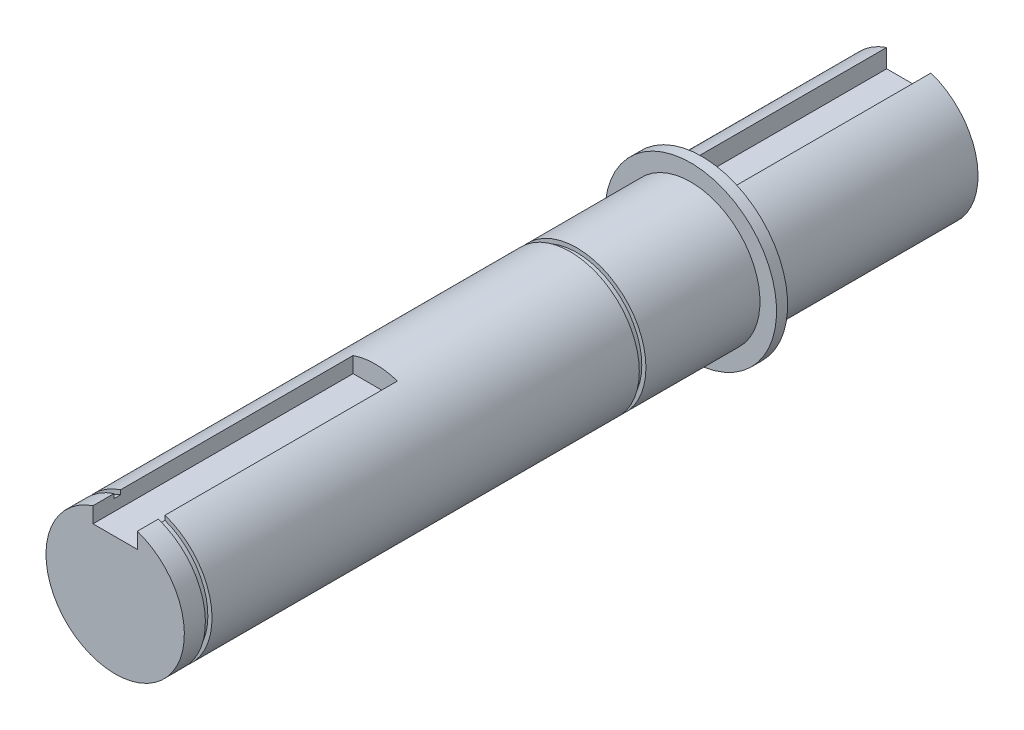
ISO-10303-21;
HEADER;
FILE_DESCRIPTION(('STEP AP214'),'2;1');
FILE_NAME('part.step','',(''),(''),'','','');
FILE_SCHEMA(('AUTOMOTIVE_DESIGN { 1 0 10303 214 1 1 1 1 }'));
ENDSEC;
DATA;
#1=APPLICATION_CONTEXT('core data for automotive mechanical design processes');
#2=APPLICATION_PROTOCOL_DEFINITION('international standard','automotive_design',2000,#1);
#3=PRODUCT_CONTEXT('',#1,'mechanical');
#4=PRODUCT('Part','Part','',(#3));
#5=PRODUCT_RELATED_PRODUCT_CATEGORY('part','',(#4));
#6=PRODUCT_DEFINITION_FORMATION('','',#4);
#7=PRODUCT_DEFINITION_CONTEXT('part definition',#1,'design');
#8=PRODUCT_DEFINITION('design','',#6,#7);
#9=PRODUCT_DEFINITION_SHAPE('','',#8);
#10=(LENGTH_UNIT() NAMED_UNIT(*) SI_UNIT(.MILLI.,.METRE.));
#11=(NAMED_UNIT(*) PLANE_ANGLE_UNIT() SI_UNIT($,.RADIAN.));
#12=(NAMED_UNIT(*) SI_UNIT($,.STERADIAN.) SOLID_ANGLE_UNIT());
#13=UNCERTAINTY_MEASURE_WITH_UNIT(LENGTH_MEASURE(1.E-05),#10,'distance_accuracy_value','');
#14=(GEOMETRIC_REPRESENTATION_CONTEXT(3) GLOBAL_UNCERTAINTY_ASSIGNED_CONTEXT((#13)) GLOBAL_UNIT_ASSIGNED_CONTEXT((#10,
#11,#12)) REPRESENTATION_CONTEXT('',''));
#15=CARTESIAN_POINT('',(0.,0.,0.));
#16=DIRECTION('',(0.,0.,1.));
#17=DIRECTION('',(1.,0.,0.));
#18=AXIS2_PLACEMENT_3D('',#15,#16,#17);
#19=CARTESIAN_POINT('',(0.,0.,143.4));
#20=DIRECTION('',(0.,0.,-1.));
#21=DIRECTION('',(-1.,0.,0.));
#22=AXIS2_PLACEMENT_3D('',#19,#20,#21);
#23=CYLINDRICAL_SURFACE('',#22,12.5);
#24=CARTESIAN_POINT('',(0.,0.,61.2));
#25=DIRECTION('',(0.,0.,1.));
#26=DIRECTION('',(1.,0.,0.));
#27=AXIS2_PLACEMENT_3D('',#24,#25,#26);
#28=CIRCLE('',#27,12.5);
#29=CARTESIAN_POINT('',(12.5,0.,61.2));
#30=VERTEX_POINT('',#29);
#31=EDGE_CURVE('E198',#30,#30,#28,.T.);
#32=ORIENTED_EDGE('',*,*,#31,.T.);
#33=EDGE_LOOP('',(#32));
#34=FACE_BOUND('',#33,.T.);
#35=CARTESIAN_POINT('',(0.,0.,138.4));
#36=DIRECTION('',(0.,0.,1.));
#37=DIRECTION('',(1.,0.,0.));
#38=AXIS2_PLACEMENT_3D('',#35,#36,#37);
#39=CIRCLE('',#38,12.5);
#40=CARTESIAN_POINT('',(-4.,11.842719282327,138.4));
#41=VERTEX_POINT('',#40);
#42=CARTESIAN_POINT('',(4.,11.842719282327,138.4));
#43=VERTEX_POINT('',#42);
#44=EDGE_CURVE('E153',#41,#43,#39,.T.);
#45=ORIENTED_EDGE('',*,*,#44,.F.);
#46=DIRECTION('',(0.,0.,-1.));
#47=VECTOR('',#46,1.);
#48=CARTESIAN_POINT('',(-4.,11.842719282327,143.4));
#49=LINE('',#48,#47);
#50=CARTESIAN_POINT('',(-4.,11.842719282327,96.4));
#51=VERTEX_POINT('',#50);
#52=EDGE_CURVE('E274',#41,#51,#49,.T.);
#53=ORIENTED_EDGE('',*,*,#52,.T.);
#54=CARTESIAN_POINT('',(0.,0.,96.4));
#55=DIRECTION('',(0.,0.,-1.));
#56=DIRECTION('',(-1.,0.,0.));
#57=AXIS2_PLACEMENT_3D('',#54,#55,#56);
#58=CIRCLE('',#57,12.5);
#59=CARTESIAN_POINT('',(4.,11.842719282327,96.4));
#60=VERTEX_POINT('',#59);
#61=EDGE_CURVE('E270',#51,#60,#58,.T.);
#62=ORIENTED_EDGE('',*,*,#61,.T.);
#63=DIRECTION('',(0.,0.,-1.));
#64=VECTOR('',#63,1.);
#65=CARTESIAN_POINT('',(4.,11.842719282327,143.4));
#66=LINE('',#65,#64);
#67=EDGE_CURVE('E279',#60,#43,#66,.F.);
#68=ORIENTED_EDGE('',*,*,#67,.T.);
#69=EDGE_LOOP('',(#45,#53,#62,#68));
#70=FACE_BOUND('',#69,.T.);
#71=ADVANCED_FACE('F45',(#34,#70),#23,.T.);
#72=CARTESIAN_POINT('',(0.,0.,39.4));
#73=DIRECTION('',(0.,0.,-1.));
#74=DIRECTION('',(-1.,0.,0.));
#75=AXIS2_PLACEMENT_3D('',#72,#73,#74);
#76=CIRCLE('',#75,12.5);
#77=CARTESIAN_POINT('',(-12.5,0.,39.4));
#78=VERTEX_POINT('',#77);
#79=EDGE_CURVE('E263',#78,#78,#76,.T.);
#80=ORIENTED_EDGE('',*,*,#79,.F.);
#81=EDGE_LOOP('',(#80));
#82=FACE_BOUND('',#81,.T.);
#83=CARTESIAN_POINT('',(0.,0.,60.));
#84=DIRECTION('',(0.,0.,1.));
#85=DIRECTION('',(1.,0.,0.));
#86=AXIS2_PLACEMENT_3D('',#83,#84,#85);
#87=CIRCLE('',#86,12.5);
#88=CARTESIAN_POINT('',(12.5,0.,60.));
#89=VERTEX_POINT('',#88);
#90=EDGE_CURVE('E194',#89,#89,#87,.T.);
#91=ORIENTED_EDGE('',*,*,#90,.F.);
#92=EDGE_LOOP('',(#91));
#93=FACE_BOUND('',#92,.T.);
#94=ADVANCED_FACE('F322',(#82,#93),#23,.T.);
#95=CARTESIAN_POINT('',(0.,0.,37.4));
#96=DIRECTION('',(0.,0.,-1.));
#97=DIRECTION('',(-1.,0.,0.));
#98=AXIS2_PLACEMENT_3D('',#95,#96,#97);
#99=CIRCLE('',#98,12.5);
#100=CARTESIAN_POINT('',(-12.5,0.,37.4));
#101=VERTEX_POINT('',#100);
#102=EDGE_CURVE('E210',#101,#101,#99,.T.);
#103=ORIENTED_EDGE('',*,*,#102,.T.);
#104=EDGE_LOOP('',(#103));
#105=FACE_BOUND('',#104,.T.);
#106=CARTESIAN_POINT('',(0.,0.,35.4));
#107=DIRECTION('',(0.,0.,1.));
#108=DIRECTION('',(1.,0.,0.));
#109=AXIS2_PLACEMENT_3D('',#106,#107,#108);
#110=CIRCLE('',#109,12.5);
#111=CARTESIAN_POINT('',(4.,11.842719282327,35.4));
#112=VERTEX_POINT('',#111);
#113=CARTESIAN_POINT('',(-4.,11.842719282327,35.4));
#114=VERTEX_POINT('',#113);
#115=EDGE_CURVE('E259',#112,#114,#110,.T.);
#116=ORIENTED_EDGE('',*,*,#115,.T.);
#117=DIRECTION('',(0.,0.,-1.));
#118=VECTOR('',#117,1.);
#119=CARTESIAN_POINT('',(-4.,11.842719282327,143.4));
#120=LINE('',#119,#118);
#121=CARTESIAN_POINT('',(-4.,11.842719282327,0.));
#122=VERTEX_POINT('',#121);
#123=EDGE_CURVE('E243',#114,#122,#120,.T.);
#124=ORIENTED_EDGE('',*,*,#123,.T.);
#125=CARTESIAN_POINT('',(0.,0.,0.));
#126=DIRECTION('',(0.,0.,1.));
#127=DIRECTION('',(1.,0.,0.));
#128=AXIS2_PLACEMENT_3D('',#125,#126,#127);
#129=CIRCLE('',#128,12.5);
#130=CARTESIAN_POINT('',(4.,11.842719282327,0.));
#131=VERTEX_POINT('',#130);
#132=EDGE_CURVE('E247',#122,#131,#129,.T.);
#133=ORIENTED_EDGE('',*,*,#132,.T.);
#134=DIRECTION('',(0.,0.,-1.));
#135=VECTOR('',#134,1.);
#136=CARTESIAN_POINT('',(4.,11.842719282327,143.4));
#137=LINE('',#136,#135);
#138=EDGE_CURVE('E236',#131,#112,#137,.F.);
#139=ORIENTED_EDGE('',*,*,#138,.T.);
#140=EDGE_LOOP('',(#116,#124,#133,#139));
#141=FACE_BOUND('',#140,.T.);
#142=ADVANCED_FACE('F47',(#105,#141),#23,.T.);
#143=CARTESIAN_POINT('',(0.,0.,0.));
#144=DIRECTION('',(0.,0.,1.));
#145=DIRECTION('',(1.,0.,0.));
#146=AXIS2_PLACEMENT_3D('',#143,#144,#145);
#147=PLANE('',#146);
#148=ORIENTED_EDGE('',*,*,#132,.F.);
#149=DIRECTION('',(0.,1.,0.));
#150=VECTOR('',#149,1.);
#151=CARTESIAN_POINT('',(-4.,8.5,0.));
#152=LINE('',#151,#150);
#153=CARTESIAN_POINT('',(-4.,8.5,0.));
#154=VERTEX_POINT('',#153);
#155=EDGE_CURVE('E227',#154,#122,#152,.T.);
#156=ORIENTED_EDGE('',*,*,#155,.F.);
#157=DIRECTION('',(-1.,0.,0.));
#158=VECTOR('',#157,1.);
#159=CARTESIAN_POINT('',(4.,8.5,0.));
#160=LINE('',#159,#158);
#161=CARTESIAN_POINT('',(4.,8.5,0.));
#162=VERTEX_POINT('',#161);
#163=EDGE_CURVE('E219',#162,#154,#160,.T.);
#164=ORIENTED_EDGE('',*,*,#163,.F.);
#165=DIRECTION('',(0.,1.,0.));
#166=VECTOR('',#165,1.);
#167=CARTESIAN_POINT('',(4.,0.,0.));
#168=LINE('',#167,#166);
#169=EDGE_CURVE('E252',#162,#131,#168,.T.);
#170=ORIENTED_EDGE('',*,*,#169,.T.);
#171=EDGE_LOOP('',(#148,#156,#164,#170));
#172=FACE_BOUND('',#171,.T.);
#173=ADVANCED_FACE('F329',(#172),#147,.F.);
#174=CARTESIAN_POINT('',(0.,0.,35.4));
#175=DIRECTION('',(0.,0.,1.));
#176=DIRECTION('',(1.,0.,0.));
#177=AXIS2_PLACEMENT_3D('',#174,#175,#176);
#178=PLANE('',#177);
#179=DIRECTION('',(0.,-1.,0.));
#180=VECTOR('',#179,1.);
#181=CARTESIAN_POINT('',(4.,8.5,35.4));
#182=LINE('',#181,#180);
#183=CARTESIAN_POINT('',(4.,8.5,35.4));
#184=VERTEX_POINT('',#183);
#185=EDGE_CURVE('E218',#112,#184,#182,.T.);
#186=ORIENTED_EDGE('',*,*,#185,.T.);
#187=DIRECTION('',(-1.,0.,0.));
#188=VECTOR('',#187,1.);
#189=CARTESIAN_POINT('',(4.,8.5,35.4));
#190=LINE('',#189,#188);
#191=CARTESIAN_POINT('',(-4.,8.5,35.4));
#192=VERTEX_POINT('',#191);
#193=EDGE_CURVE('E222',#184,#192,#190,.T.);
#194=ORIENTED_EDGE('',*,*,#193,.T.);
#195=DIRECTION('',(0.,1.,0.));
#196=VECTOR('',#195,1.);
#197=CARTESIAN_POINT('',(-4.,8.5,35.4));
#198=LINE('',#197,#196);
#199=EDGE_CURVE('E214',#192,#114,#198,.T.);
#200=ORIENTED_EDGE('',*,*,#199,.T.);
#201=ORIENTED_EDGE('',*,*,#115,.F.);
#202=EDGE_LOOP('',(#186,#194,#200,#201));
#203=FACE_BOUND('',#202,.T.);
#204=ADVANCED_FACE('F334',(#203),#178,.F.);
#205=CARTESIAN_POINT('',(-4.,8.5,35.4));
#206=DIRECTION('',(-1.,0.,0.));
#207=DIRECTION('',(0.,0.,1.));
#208=AXIS2_PLACEMENT_3D('',#205,#206,#207);
#209=PLANE('',#208);
#210=ORIENTED_EDGE('',*,*,#199,.F.);
#211=DIRECTION('',(0.,0.,-1.));
#212=VECTOR('',#211,1.);
#213=CARTESIAN_POINT('',(-4.,8.5,35.4));
#214=LINE('',#213,#212);
#215=EDGE_CURVE('E233',#192,#154,#214,.T.);
#216=ORIENTED_EDGE('',*,*,#215,.T.);
#217=ORIENTED_EDGE('',*,*,#155,.T.);
#218=ORIENTED_EDGE('',*,*,#123,.F.);
#219=EDGE_LOOP('',(#210,#216,#217,#218));
#220=FACE_BOUND('',#219,.T.);
#221=ADVANCED_FACE('F352',(#220),#209,.F.);
#222=CARTESIAN_POINT('',(4.,8.5,35.4));
#223=DIRECTION('',(1.,0.,0.));
#224=DIRECTION('',(0.,0.,-1.));
#225=AXIS2_PLACEMENT_3D('',#222,#223,#224);
#226=PLANE('',#225);
#227=ORIENTED_EDGE('',*,*,#169,.F.);
#228=DIRECTION('',(0.,0.,-1.));
#229=VECTOR('',#228,1.);
#230=CARTESIAN_POINT('',(4.,8.5,35.4));
#231=LINE('',#230,#229);
#232=EDGE_CURVE('E226',#184,#162,#231,.T.);
#233=ORIENTED_EDGE('',*,*,#232,.F.);
#234=ORIENTED_EDGE('',*,*,#185,.F.);
#235=ORIENTED_EDGE('',*,*,#138,.F.);
#236=EDGE_LOOP('',(#227,#233,#234,#235));
#237=FACE_BOUND('',#236,.T.);
#238=ADVANCED_FACE('F355',(#237),#226,.F.);
#239=CARTESIAN_POINT('',(4.,8.5,35.4));
#240=DIRECTION('',(0.,-1.,0.));
#241=DIRECTION('',(0.,0.,-1.));
#242=AXIS2_PLACEMENT_3D('',#239,#240,#241);
#243=PLANE('',#242);
#244=ORIENTED_EDGE('',*,*,#163,.T.);
#245=ORIENTED_EDGE('',*,*,#215,.F.);
#246=ORIENTED_EDGE('',*,*,#193,.F.);
#247=ORIENTED_EDGE('',*,*,#232,.T.);
#248=EDGE_LOOP('',(#244,#245,#246,#247));
#249=FACE_BOUND('',#248,.T.);
#250=ADVANCED_FACE('F359',(#249),#243,.F.);
#251=CARTESIAN_POINT('',(0.,0.,39.4));
#252=DIRECTION('',(0.,0.,-1.));
#253=DIRECTION('',(-1.,0.,0.));
#254=AXIS2_PLACEMENT_3D('',#251,#252,#253);
#255=CYLINDRICAL_SURFACE('',#254,15.5);
#256=CARTESIAN_POINT('',(0.,0.,39.4));
#257=DIRECTION('',(0.,0.,-1.));
#258=DIRECTION('',(-1.,0.,0.));
#259=AXIS2_PLACEMENT_3D('',#256,#257,#258);
#260=CIRCLE('',#259,15.5);
#261=CARTESIAN_POINT('',(-15.5,0.,39.4));
#262=VERTEX_POINT('',#261);
#263=EDGE_CURVE('E206',#262,#262,#260,.T.);
#264=ORIENTED_EDGE('',*,*,#263,.T.);
#265=EDGE_LOOP('',(#264));
#266=FACE_BOUND('',#265,.T.);
#267=CARTESIAN_POINT('',(0.,0.,37.4));
#268=DIRECTION('',(0.,0.,-1.));
#269=DIRECTION('',(-1.,0.,0.));
#270=AXIS2_PLACEMENT_3D('',#267,#268,#269);
#271=CIRCLE('',#270,15.5);
#272=CARTESIAN_POINT('',(-15.5,0.,37.4));
#273=VERTEX_POINT('',#272);
#274=EDGE_CURVE('E202',#273,#273,#271,.T.);
#275=ORIENTED_EDGE('',*,*,#274,.F.);
#276=EDGE_LOOP('',(#275));
#277=FACE_BOUND('',#276,.T.);
#278=ADVANCED_FACE('F363',(#266,#277),#255,.T.);
#279=CARTESIAN_POINT('',(0.,0.,39.4));
#280=DIRECTION('',(0.,0.,-1.));
#281=DIRECTION('',(-1.,0.,0.));
#282=AXIS2_PLACEMENT_3D('',#279,#280,#281);
#283=PLANE('',#282);
#284=ORIENTED_EDGE('',*,*,#79,.T.);
#285=EDGE_LOOP('',(#284));
#286=FACE_BOUND('',#285,.T.);
#287=ORIENTED_EDGE('',*,*,#263,.F.);
#288=EDGE_LOOP('',(#287));
#289=FACE_BOUND('',#288,.T.);
#290=ADVANCED_FACE('F370',(#286,#289),#283,.F.);
#291=CARTESIAN_POINT('',(0.,0.,37.4));
#292=DIRECTION('',(0.,0.,-1.));
#293=DIRECTION('',(-1.,0.,0.));
#294=AXIS2_PLACEMENT_3D('',#291,#292,#293);
#295=PLANE('',#294);
#296=ORIENTED_EDGE('',*,*,#102,.F.);
#297=EDGE_LOOP('',(#296));
#298=FACE_BOUND('',#297,.T.);
#299=ORIENTED_EDGE('',*,*,#274,.T.);
#300=EDGE_LOOP('',(#299));
#301=FACE_BOUND('',#300,.T.);
#302=ADVANCED_FACE('F372',(#298,#301),#295,.T.);
#303=CARTESIAN_POINT('',(0.,0.,61.2));
#304=DIRECTION('',(0.,0.,1.));
#305=DIRECTION('',(1.,0.,0.));
#306=AXIS2_PLACEMENT_3D('',#303,#304,#305);
#307=PLANE('',#306);
#308=ORIENTED_EDGE('',*,*,#31,.F.);
#309=EDGE_LOOP('',(#308));
#310=FACE_BOUND('',#309,.T.);
#311=CARTESIAN_POINT('',(0.,0.,61.2));
#312=DIRECTION('',(0.,0.,1.));
#313=DIRECTION('',(1.,0.,0.));
#314=AXIS2_PLACEMENT_3D('',#311,#312,#313);
#315=CIRCLE('',#314,11.75);
#316=CARTESIAN_POINT('',(11.75,0.,61.2));
#317=VERTEX_POINT('',#316);
#318=EDGE_CURVE('E190',#317,#317,#315,.T.);
#319=ORIENTED_EDGE('',*,*,#318,.T.);
#320=EDGE_LOOP('',(#319));
#321=FACE_BOUND('',#320,.T.);
#322=ADVANCED_FACE('F375',(#310,#321),#307,.F.);
#323=CARTESIAN_POINT('',(0.,0.,60.));
#324=DIRECTION('',(0.,0.,1.));
#325=DIRECTION('',(1.,0.,0.));
#326=AXIS2_PLACEMENT_3D('',#323,#324,#325);
#327=PLANE('',#326);
#328=ORIENTED_EDGE('',*,*,#90,.T.);
#329=EDGE_LOOP('',(#328));
#330=FACE_BOUND('',#329,.T.);
#331=CARTESIAN_POINT('',(0.,0.,60.));
#332=DIRECTION('',(0.,0.,1.));
#333=DIRECTION('',(1.,0.,0.));
#334=AXIS2_PLACEMENT_3D('',#331,#332,#333);
#335=CIRCLE('',#334,11.75);
#336=CARTESIAN_POINT('',(11.75,0.,60.));
#337=VERTEX_POINT('',#336);
#338=EDGE_CURVE('E186',#337,#337,#335,.T.);
#339=ORIENTED_EDGE('',*,*,#338,.F.);
#340=EDGE_LOOP('',(#339));
#341=FACE_BOUND('',#340,.T.);
#342=ADVANCED_FACE('F348',(#330,#341),#327,.T.);
#343=CARTESIAN_POINT('',(0.,0.,61.2));
#344=DIRECTION('',(0.,0.,-1.));
#345=DIRECTION('',(-1.,0.,0.));
#346=AXIS2_PLACEMENT_3D('',#343,#344,#345);
#347=CYLINDRICAL_SURFACE('',#346,11.75);
#348=ORIENTED_EDGE('',*,*,#318,.F.);
#349=EDGE_LOOP('',(#348));
#350=FACE_BOUND('',#349,.T.);
#351=ORIENTED_EDGE('',*,*,#338,.T.);
#352=EDGE_LOOP('',(#351));
#353=FACE_BOUND('',#352,.T.);
#354=ADVANCED_FACE('F343',(#350,#353),#347,.T.);
#355=CARTESIAN_POINT('',(0.,0.,143.4));
#356=DIRECTION('',(0.,0.,1.));
#357=DIRECTION('',(1.,0.,0.));
#358=AXIS2_PLACEMENT_3D('',#355,#356,#357);
#359=PLANE('',#358);
#360=DIRECTION('',(0.,1.,0.));
#361=VECTOR('',#360,1.);
#362=CARTESIAN_POINT('',(4.,9.,143.4));
#363=LINE('',#362,#361);
#364=CARTESIAN_POINT('',(4.,9.,143.4));
#365=VERTEX_POINT('',#364);
#366=CARTESIAN_POINT('',(4.,11.842719282327,143.4));
#367=VERTEX_POINT('',#366);
#368=EDGE_CURVE('E160',#365,#367,#363,.T.);
#369=ORIENTED_EDGE('',*,*,#368,.F.);
#370=DIRECTION('',(1.,0.,0.));
#371=VECTOR('',#370,1.);
#372=CARTESIAN_POINT('',(-4.,9.,143.4));
#373=LINE('',#372,#371);
#374=CARTESIAN_POINT('',(-4.,9.,143.4));
#375=VERTEX_POINT('',#374);
#376=EDGE_CURVE('E171',#375,#365,#373,.T.);
#377=ORIENTED_EDGE('',*,*,#376,.F.);
#378=DIRECTION('',(0.,-1.,0.));
#379=VECTOR('',#378,1.);
#380=CARTESIAN_POINT('',(-4.,9.,143.4));
#381=LINE('',#380,#379);
#382=CARTESIAN_POINT('',(-4.,11.842719282327,143.4));
#383=VERTEX_POINT('',#382);
#384=EDGE_CURVE('E164',#383,#375,#381,.T.);
#385=ORIENTED_EDGE('',*,*,#384,.F.);
#386=CARTESIAN_POINT('',(0.,0.,143.4));
#387=DIRECTION('',(0.,0.,1.));
#388=DIRECTION('',(1.,0.,0.));
#389=AXIS2_PLACEMENT_3D('',#386,#387,#388);
#390=CIRCLE('',#389,12.5);
#391=EDGE_CURVE('E248',#383,#367,#390,.T.);
#392=ORIENTED_EDGE('',*,*,#391,.T.);
#393=EDGE_LOOP('',(#369,#377,#385,#392));
#394=FACE_BOUND('',#393,.T.);
#395=ADVANCED_FACE('F307',(#394),#359,.T.);
#396=CARTESIAN_POINT('',(-4.,11.842719282327,139.6));
#397=VERTEX_POINT('',#396);
#398=EDGE_CURVE('E275',#383,#397,#49,.T.);
#399=ORIENTED_EDGE('',*,*,#398,.T.);
#400=CARTESIAN_POINT('',(0.,0.,139.6));
#401=DIRECTION('',(0.,0.,1.));
#402=DIRECTION('',(1.,0.,0.));
#403=AXIS2_PLACEMENT_3D('',#400,#401,#402);
#404=CIRCLE('',#403,12.5);
#405=CARTESIAN_POINT('',(4.,11.842719282327,139.6));
#406=VERTEX_POINT('',#405);
#407=EDGE_CURVE('E145',#397,#406,#404,.T.);
#408=ORIENTED_EDGE('',*,*,#407,.T.);
#409=EDGE_CURVE('E158',#406,#367,#66,.F.);
#410=ORIENTED_EDGE('',*,*,#409,.T.);
#411=ORIENTED_EDGE('',*,*,#391,.F.);
#412=EDGE_LOOP('',(#399,#408,#410,#411));
#413=FACE_BOUND('',#412,.T.);
#414=ADVANCED_FACE('F302',(#413),#23,.T.);
#415=CARTESIAN_POINT('',(4.,9.,96.4));
#416=DIRECTION('',(1.,0.,0.));
#417=DIRECTION('',(0.,0.,-1.));
#418=AXIS2_PLACEMENT_3D('',#415,#416,#417);
#419=PLANE('',#418);
#420=ORIENTED_EDGE('',*,*,#409,.F.);
#421=DIRECTION('',(0.,-1.,0.));
#422=VECTOR('',#421,1.);
#423=CARTESIAN_POINT('',(4.,9.,139.6));
#424=LINE('',#423,#422);
#425=CARTESIAN_POINT('',(4.,11.0481898969922,139.6));
#426=VERTEX_POINT('',#425);
#427=EDGE_CURVE('E149',#406,#426,#424,.T.);
#428=ORIENTED_EDGE('',*,*,#427,.T.);
#429=DIRECTION('',(0.,0.,-1.));
#430=VECTOR('',#429,1.);
#431=CARTESIAN_POINT('',(4.,11.0481898969922,139.6));
#432=LINE('',#431,#430);
#433=CARTESIAN_POINT('',(4.,11.0481898969922,138.4));
#434=VERTEX_POINT('',#433);
#435=EDGE_CURVE('E136',#426,#434,#432,.T.);
#436=ORIENTED_EDGE('',*,*,#435,.T.);
#437=DIRECTION('',(0.,-1.,0.));
#438=VECTOR('',#437,1.);
#439=CARTESIAN_POINT('',(4.,9.,138.4));
#440=LINE('',#439,#438);
#441=EDGE_CURVE('E144',#43,#434,#440,.T.);
#442=ORIENTED_EDGE('',*,*,#441,.F.);
#443=ORIENTED_EDGE('',*,*,#67,.F.);
#444=DIRECTION('',(0.,1.,0.));
#445=VECTOR('',#444,1.);
#446=CARTESIAN_POINT('',(4.,9.,96.4));
#447=LINE('',#446,#445);
#448=CARTESIAN_POINT('',(4.,9.,96.4));
#449=VERTEX_POINT('',#448);
#450=EDGE_CURVE('E69',#449,#60,#447,.T.);
#451=ORIENTED_EDGE('',*,*,#450,.F.);
#452=DIRECTION('',(0.,0.,1.));
#453=VECTOR('',#452,1.);
#454=CARTESIAN_POINT('',(4.,9.,96.4));
#455=LINE('',#454,#453);
#456=EDGE_CURVE('E183',#449,#365,#455,.T.);
#457=ORIENTED_EDGE('',*,*,#456,.T.);
#458=ORIENTED_EDGE('',*,*,#368,.T.);
#459=EDGE_LOOP('',(#420,#428,#436,#442,#443,#451,#457,#458));
#460=FACE_BOUND('',#459,.T.);
#461=ADVANCED_FACE('F156',(#460),#419,.F.);
#462=CARTESIAN_POINT('',(-4.,9.,96.4));
#463=DIRECTION('',(-1.,0.,0.));
#464=DIRECTION('',(0.,0.,1.));
#465=AXIS2_PLACEMENT_3D('',#462,#463,#464);
#466=PLANE('',#465);
#467=DIRECTION('',(0.,0.,-1.));
#468=VECTOR('',#467,1.);
#469=CARTESIAN_POINT('',(-4.,11.0481898969922,139.6));
#470=LINE('',#469,#468);
#471=CARTESIAN_POINT('',(-4.,11.0481898969922,138.4));
#472=VERTEX_POINT('',#471);
#473=CARTESIAN_POINT('',(-4.,11.0481898969922,139.6));
#474=VERTEX_POINT('',#473);
#475=EDGE_CURVE('E283',#472,#474,#470,.F.);
#476=ORIENTED_EDGE('',*,*,#475,.T.);
#477=DIRECTION('',(0.,1.,0.));
#478=VECTOR('',#477,1.);
#479=CARTESIAN_POINT('',(-4.,9.,139.6));
#480=LINE('',#479,#478);
#481=EDGE_CURVE('E12',#474,#397,#480,.T.);
#482=ORIENTED_EDGE('',*,*,#481,.T.);
#483=ORIENTED_EDGE('',*,*,#398,.F.);
#484=ORIENTED_EDGE('',*,*,#384,.T.);
#485=DIRECTION('',(0.,0.,1.));
#486=VECTOR('',#485,1.);
#487=CARTESIAN_POINT('',(-4.,9.,96.4));
#488=LINE('',#487,#486);
#489=CARTESIAN_POINT('',(-4.,9.,96.4));
#490=VERTEX_POINT('',#489);
#491=EDGE_CURVE('E176',#490,#375,#488,.T.);
#492=ORIENTED_EDGE('',*,*,#491,.F.);
#493=DIRECTION('',(0.,-1.,0.));
#494=VECTOR('',#493,1.);
#495=CARTESIAN_POINT('',(-4.,9.,96.4));
#496=LINE('',#495,#494);
#497=EDGE_CURVE('E170',#51,#490,#496,.T.);
#498=ORIENTED_EDGE('',*,*,#497,.F.);
#499=ORIENTED_EDGE('',*,*,#52,.F.);
#500=DIRECTION('',(0.,1.,0.));
#501=VECTOR('',#500,1.);
#502=CARTESIAN_POINT('',(-4.,9.,138.4));
#503=LINE('',#502,#501);
#504=EDGE_CURVE('E54',#472,#41,#503,.T.);
#505=ORIENTED_EDGE('',*,*,#504,.F.);
#506=EDGE_LOOP('',(#476,#482,#483,#484,#492,#498,#499,#505));
#507=FACE_BOUND('',#506,.T.);
#508=ADVANCED_FACE('F296',(#507),#466,.F.);
#509=CARTESIAN_POINT('',(0.,0.,96.4));
#510=DIRECTION('',(0.,0.,-1.));
#511=DIRECTION('',(-1.,0.,0.));
#512=AXIS2_PLACEMENT_3D('',#509,#510,#511);
#513=PLANE('',#512);
#514=ORIENTED_EDGE('',*,*,#497,.T.);
#515=DIRECTION('',(1.,0.,0.));
#516=VECTOR('',#515,1.);
#517=CARTESIAN_POINT('',(-4.,9.,96.4));
#518=LINE('',#517,#516);
#519=EDGE_CURVE('E174',#490,#449,#518,.T.);
#520=ORIENTED_EDGE('',*,*,#519,.T.);
#521=ORIENTED_EDGE('',*,*,#450,.T.);
#522=ORIENTED_EDGE('',*,*,#61,.F.);
#523=EDGE_LOOP('',(#514,#520,#521,#522));
#524=FACE_BOUND('',#523,.T.);
#525=ADVANCED_FACE('F311',(#524),#513,.F.);
#526=CARTESIAN_POINT('',(-4.,9.,96.4));
#527=DIRECTION('',(0.,-1.,0.));
#528=DIRECTION('',(0.,0.,-1.));
#529=AXIS2_PLACEMENT_3D('',#526,#527,#528);
#530=PLANE('',#529);
#531=ORIENTED_EDGE('',*,*,#376,.T.);
#532=ORIENTED_EDGE('',*,*,#456,.F.);
#533=ORIENTED_EDGE('',*,*,#519,.F.);
#534=ORIENTED_EDGE('',*,*,#491,.T.);
#535=EDGE_LOOP('',(#531,#532,#533,#534));
#536=FACE_BOUND('',#535,.T.);
#537=ADVANCED_FACE('F310',(#536),#530,.F.);
#538=CARTESIAN_POINT('',(0.,0.,139.6));
#539=DIRECTION('',(0.,0.,1.));
#540=DIRECTION('',(1.,0.,0.));
#541=AXIS2_PLACEMENT_3D('',#538,#539,#540);
#542=PLANE('',#541);
#543=ORIENTED_EDGE('',*,*,#407,.F.);
#544=ORIENTED_EDGE('',*,*,#481,.F.);
#545=CARTESIAN_POINT('',(0.,0.,139.6));
#546=DIRECTION('',(0.,0.,1.));
#547=DIRECTION('',(1.,0.,0.));
#548=AXIS2_PLACEMENT_3D('',#545,#546,#547);
#549=CIRCLE('',#548,11.75);
#550=EDGE_CURVE('E61',#474,#426,#549,.T.);
#551=ORIENTED_EDGE('',*,*,#550,.T.);
#552=ORIENTED_EDGE('',*,*,#427,.F.);
#553=EDGE_LOOP('',(#543,#544,#551,#552));
#554=FACE_BOUND('',#553,.T.);
#555=ADVANCED_FACE('F148',(#554),#542,.F.);
#556=CARTESIAN_POINT('',(0.,0.,138.4));
#557=DIRECTION('',(0.,0.,1.));
#558=DIRECTION('',(1.,0.,0.));
#559=AXIS2_PLACEMENT_3D('',#556,#557,#558);
#560=PLANE('',#559);
#561=ORIENTED_EDGE('',*,*,#441,.T.);
#562=CARTESIAN_POINT('',(0.,0.,138.4));
#563=DIRECTION('',(0.,0.,1.));
#564=DIRECTION('',(1.,0.,0.));
#565=AXIS2_PLACEMENT_3D('',#562,#563,#564);
#566=CIRCLE('',#565,11.75);
#567=EDGE_CURVE('E139',#472,#434,#566,.T.);
#568=ORIENTED_EDGE('',*,*,#567,.F.);
#569=ORIENTED_EDGE('',*,*,#504,.T.);
#570=ORIENTED_EDGE('',*,*,#44,.T.);
#571=EDGE_LOOP('',(#561,#568,#569,#570));
#572=FACE_BOUND('',#571,.T.);
#573=ADVANCED_FACE('F289',(#572),#560,.T.);
#574=CARTESIAN_POINT('',(0.,0.,139.6));
#575=DIRECTION('',(0.,0.,-1.));
#576=DIRECTION('',(-1.,0.,0.));
#577=AXIS2_PLACEMENT_3D('',#574,#575,#576);
#578=CYLINDRICAL_SURFACE('',#577,11.75);
#579=ORIENTED_EDGE('',*,*,#550,.F.);
#580=ORIENTED_EDGE('',*,*,#475,.F.);
#581=ORIENTED_EDGE('',*,*,#567,.T.);
#582=ORIENTED_EDGE('',*,*,#435,.F.);
#583=EDGE_LOOP('',(#579,#580,#581,#582));
#584=FACE_BOUND('',#583,.T.);
#585=ADVANCED_FACE('F137',(#584),#578,.T.);
#586=CLOSED_SHELL('',(#71,#94,#142,#173,#204,#221,#238,#250,#278,#290,#302,#322,#342,#354,#395,
#414,#461,#508,#525,#537,#555,#573,#585));
#587=MANIFOLD_SOLID_BREP('B2',#586);
#588=ADVANCED_BREP_SHAPE_REPRESENTATION('',(#18,#587),#14);
#589=SHAPE_DEFINITION_REPRESENTATION(#9,#588);
ENDSEC;
END-ISO-10303-21;
